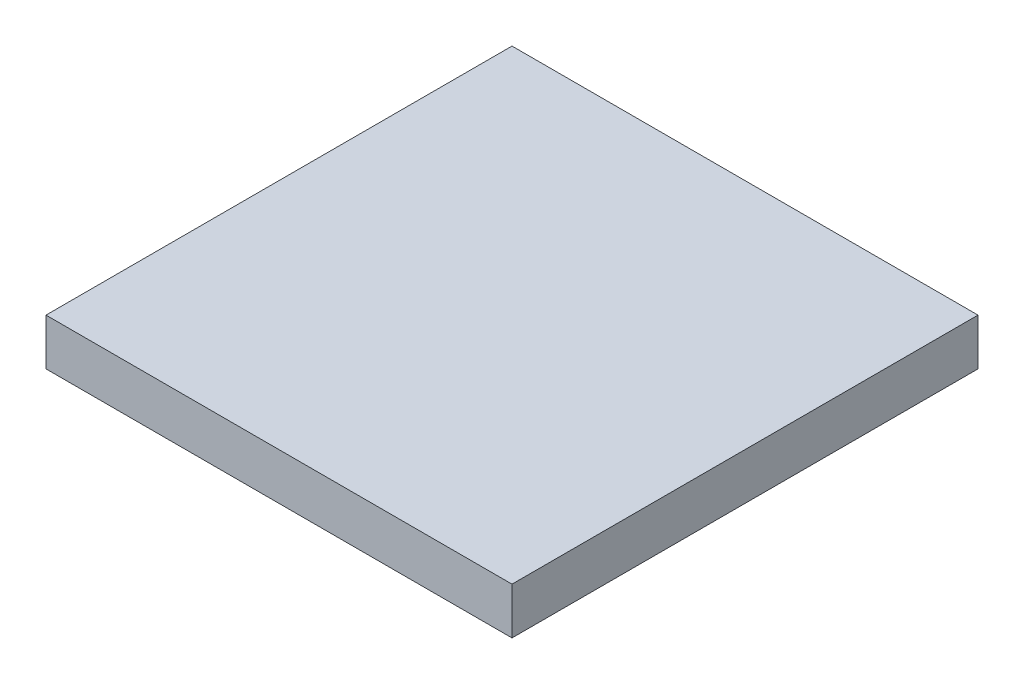
ISO-10303-21;
HEADER;
FILE_DESCRIPTION(('STEP AP214'),'2;1');
FILE_NAME('part.step','',(''),(''),'','','');
FILE_SCHEMA(('AUTOMOTIVE_DESIGN { 1 0 10303 214 1 1 1 1 }'));
ENDSEC;
DATA;
#1=APPLICATION_CONTEXT('core data for automotive mechanical design processes');
#2=APPLICATION_PROTOCOL_DEFINITION('international standard','automotive_design',2000,#1);
#3=PRODUCT_CONTEXT('',#1,'mechanical');
#4=PRODUCT('Part','Part','',(#3));
#5=PRODUCT_RELATED_PRODUCT_CATEGORY('part','',(#4));
#6=PRODUCT_DEFINITION_FORMATION('','',#4);
#7=PRODUCT_DEFINITION_CONTEXT('part definition',#1,'design');
#8=PRODUCT_DEFINITION('design','',#6,#7);
#9=PRODUCT_DEFINITION_SHAPE('','',#8);
#10=(LENGTH_UNIT() NAMED_UNIT(*) SI_UNIT(.MILLI.,.METRE.));
#11=(NAMED_UNIT(*) PLANE_ANGLE_UNIT() SI_UNIT($,.RADIAN.));
#12=(NAMED_UNIT(*) SI_UNIT($,.STERADIAN.) SOLID_ANGLE_UNIT());
#13=UNCERTAINTY_MEASURE_WITH_UNIT(LENGTH_MEASURE(1.E-05),#10,'distance_accuracy_value','');
#14=(GEOMETRIC_REPRESENTATION_CONTEXT(3) GLOBAL_UNCERTAINTY_ASSIGNED_CONTEXT((#13)) GLOBAL_UNIT_ASSIGNED_CONTEXT((#10,
#11,#12)) REPRESENTATION_CONTEXT('',''));
#15=CARTESIAN_POINT('',(0.,0.,0.));
#16=DIRECTION('',(0.,0.,1.));
#17=DIRECTION('',(1.,0.,0.));
#18=AXIS2_PLACEMENT_3D('',#15,#16,#17);
#19=CARTESIAN_POINT('',(5.00000000000013,-1.,-5.));
#20=DIRECTION('',(0.,1.,0.));
#21=DIRECTION('',(0.,0.,1.));
#22=AXIS2_PLACEMENT_3D('',#19,#20,#21);
#23=CYLINDRICAL_SURFACE('',#22,1.5);
#24=CARTESIAN_POINT('',(5.00000000000013,-1.,-5.));
#25=DIRECTION('',(0.,1.,0.));
#26=DIRECTION('',(0.,0.,1.));
#27=AXIS2_PLACEMENT_3D('',#24,#25,#26);
#28=CIRCLE('',#27,1.5);
#29=CARTESIAN_POINT('',(5.00000000000013,-1.,-3.5));
#30=VERTEX_POINT('',#29);
#31=EDGE_CURVE('E379',#30,#30,#28,.T.);
#32=ORIENTED_EDGE('',*,*,#31,.F.);
#33=EDGE_LOOP('',(#32));
#34=FACE_BOUND('',#33,.T.);
#35=CARTESIAN_POINT('',(5.00000000000013,0.,-5.));
#36=DIRECTION('',(0.,1.,0.));
#37=DIRECTION('',(0.,0.,1.));
#38=AXIS2_PLACEMENT_3D('',#35,#36,#37);
#39=CIRCLE('',#38,1.5);
#40=CARTESIAN_POINT('',(5.00000000000013,0.,-3.5));
#41=VERTEX_POINT('',#40);
#42=EDGE_CURVE('E370',#41,#41,#39,.F.);
#43=ORIENTED_EDGE('',*,*,#42,.F.);
#44=EDGE_LOOP('',(#43));
#45=FACE_BOUND('',#44,.T.);
#46=ADVANCED_FACE('F170',(#34,#45),#23,.F.);
#47=CARTESIAN_POINT('',(5.00000000000013,-1.,-5.));
#48=DIRECTION('',(0.,1.,0.));
#49=DIRECTION('',(0.,0.,1.));
#50=AXIS2_PLACEMENT_3D('',#47,#48,#49);
#51=CYLINDRICAL_SURFACE('',#50,2.03553390593276);
#52=CARTESIAN_POINT('',(5.00000000000013,-1.,-5.));
#53=DIRECTION('',(0.,1.,0.));
#54=DIRECTION('',(0.,0.,1.));
#55=AXIS2_PLACEMENT_3D('',#52,#53,#54);
#56=CIRCLE('',#55,2.03553390593276);
#57=CARTESIAN_POINT('',(5.00000000000013,-1.,-2.96446609406724));
#58=VERTEX_POINT('',#57);
#59=EDGE_CURVE('E382',#58,#58,#56,.T.);
#60=ORIENTED_EDGE('',*,*,#59,.T.);
#61=EDGE_LOOP('',(#60));
#62=FACE_BOUND('',#61,.T.);
#63=CARTESIAN_POINT('',(5.00000000000013,0.,-5.));
#64=DIRECTION('',(0.,1.,0.));
#65=DIRECTION('',(0.,0.,1.));
#66=AXIS2_PLACEMENT_3D('',#63,#64,#65);
#67=CIRCLE('',#66,2.03553390593276);
#68=CARTESIAN_POINT('',(5.00000000000013,0.,-2.96446609406724));
#69=VERTEX_POINT('',#68);
#70=EDGE_CURVE('E378',#69,#69,#67,.T.);
#71=ORIENTED_EDGE('',*,*,#70,.F.);
#72=EDGE_LOOP('',(#71));
#73=FACE_BOUND('',#72,.T.);
#74=ADVANCED_FACE('F437',(#62,#73),#51,.T.);
#75=CARTESIAN_POINT('',(0.,-1.,0.));
#76=DIRECTION('',(0.,1.,0.));
#77=DIRECTION('',(0.,0.,1.));
#78=AXIS2_PLACEMENT_3D('',#75,#76,#77);
#79=PLANE('',#78);
#80=ORIENTED_EDGE('',*,*,#31,.T.);
#81=EDGE_LOOP('',(#80));
#82=FACE_BOUND('',#81,.T.);
#83=ORIENTED_EDGE('',*,*,#59,.F.);
#84=EDGE_LOOP('',(#83));
#85=FACE_BOUND('',#84,.T.);
#86=ADVANCED_FACE('F442',(#82,#85),#79,.F.);
#87=CARTESIAN_POINT('',(0.,0.,0.));
#88=DIRECTION('',(0.,1.,0.));
#89=DIRECTION('',(0.,0.,1.));
#90=AXIS2_PLACEMENT_3D('',#87,#88,#89);
#91=PLANE('',#90);
#92=DIRECTION('',(1.,0.,0.));
#93=VECTOR('',#92,1.);
#94=CARTESIAN_POINT('',(0.,0.,-1.));
#95=LINE('',#94,#93);
#96=CARTESIAN_POINT('',(1.,0.,-1.));
#97=VERTEX_POINT('',#96);
#98=CARTESIAN_POINT('',(19.,0.,-1.));
#99=VERTEX_POINT('',#98);
#100=EDGE_CURVE('E261',#97,#99,#95,.T.);
#101=ORIENTED_EDGE('',*,*,#100,.F.);
#102=DIRECTION('',(0.,0.,-1.));
#103=VECTOR('',#102,1.);
#104=CARTESIAN_POINT('',(1.,0.,0.));
#105=LINE('',#104,#103);
#106=CARTESIAN_POINT('',(1.,0.,-19.));
#107=VERTEX_POINT('',#106);
#108=EDGE_CURVE('E279',#97,#107,#105,.T.);
#109=ORIENTED_EDGE('',*,*,#108,.T.);
#110=DIRECTION('',(1.,0.,0.));
#111=VECTOR('',#110,1.);
#112=CARTESIAN_POINT('',(0.,0.,-19.));
#113=LINE('',#112,#111);
#114=CARTESIAN_POINT('',(19.,0.,-19.));
#115=VERTEX_POINT('',#114);
#116=EDGE_CURVE('E242',#107,#115,#113,.T.);
#117=ORIENTED_EDGE('',*,*,#116,.T.);
#118=DIRECTION('',(0.,0.,-1.));
#119=VECTOR('',#118,1.);
#120=CARTESIAN_POINT('',(19.,0.,0.));
#121=LINE('',#120,#119);
#122=EDGE_CURVE('E184',#99,#115,#121,.T.);
#123=ORIENTED_EDGE('',*,*,#122,.F.);
#124=EDGE_LOOP('',(#101,#109,#117,#123));
#125=FACE_BOUND('',#124,.T.);
#126=CARTESIAN_POINT('',(10.,0.,-15.));
#127=DIRECTION('',(0.,1.,0.));
#128=DIRECTION('',(0.,0.,1.));
#129=AXIS2_PLACEMENT_3D('',#126,#127,#128);
#130=CIRCLE('',#129,2.03553390593276);
#131=CARTESIAN_POINT('',(10.,0.,-12.9644660940672));
#132=VERTEX_POINT('',#131);
#133=EDGE_CURVE('E284',#132,#132,#130,.T.);
#134=ORIENTED_EDGE('',*,*,#133,.T.);
#135=EDGE_LOOP('',(#134));
#136=FACE_BOUND('',#135,.T.);
#137=CARTESIAN_POINT('',(10.0000000000001,0.,-10.));
#138=DIRECTION('',(0.,1.,0.));
#139=DIRECTION('',(0.,0.,1.));
#140=AXIS2_PLACEMENT_3D('',#137,#138,#139);
#141=CIRCLE('',#140,2.03553390593276);
#142=CARTESIAN_POINT('',(10.0000000000001,0.,-7.96446609406724));
#143=VERTEX_POINT('',#142);
#144=EDGE_CURVE('E294',#143,#143,#141,.T.);
#145=ORIENTED_EDGE('',*,*,#144,.T.);
#146=EDGE_LOOP('',(#145));
#147=FACE_BOUND('',#146,.T.);
#148=CARTESIAN_POINT('',(15.0000000000001,0.,-10.));
#149=DIRECTION('',(0.,1.,0.));
#150=DIRECTION('',(0.,0.,1.));
#151=AXIS2_PLACEMENT_3D('',#148,#149,#150);
#152=CIRCLE('',#151,2.03553390593276);
#153=CARTESIAN_POINT('',(15.0000000000001,0.,-7.96446609406724));
#154=VERTEX_POINT('',#153);
#155=EDGE_CURVE('E303',#154,#154,#152,.T.);
#156=ORIENTED_EDGE('',*,*,#155,.T.);
#157=EDGE_LOOP('',(#156));
#158=FACE_BOUND('',#157,.T.);
#159=CARTESIAN_POINT('',(15.,0.,-15.));
#160=DIRECTION('',(0.,1.,0.));
#161=DIRECTION('',(0.,0.,1.));
#162=AXIS2_PLACEMENT_3D('',#159,#160,#161);
#163=CIRCLE('',#162,2.03553390593276);
#164=CARTESIAN_POINT('',(15.,0.,-12.9644660940672));
#165=VERTEX_POINT('',#164);
#166=EDGE_CURVE('E312',#165,#165,#163,.T.);
#167=ORIENTED_EDGE('',*,*,#166,.T.);
#168=EDGE_LOOP('',(#167));
#169=FACE_BOUND('',#168,.T.);
#170=CARTESIAN_POINT('',(15.0000000000001,0.,-5.));
#171=DIRECTION('',(0.,1.,0.));
#172=DIRECTION('',(0.,0.,1.));
#173=AXIS2_PLACEMENT_3D('',#170,#171,#172);
#174=CIRCLE('',#173,2.03553390593276);
#175=CARTESIAN_POINT('',(15.0000000000001,0.,-2.96446609406724));
#176=VERTEX_POINT('',#175);
#177=EDGE_CURVE('E321',#176,#176,#174,.T.);
#178=ORIENTED_EDGE('',*,*,#177,.T.);
#179=EDGE_LOOP('',(#178));
#180=FACE_BOUND('',#179,.T.);
#181=CARTESIAN_POINT('',(10.0000000000001,0.,-5.));
#182=DIRECTION('',(0.,1.,0.));
#183=DIRECTION('',(0.,0.,1.));
#184=AXIS2_PLACEMENT_3D('',#181,#182,#183);
#185=CIRCLE('',#184,2.03553390593276);
#186=CARTESIAN_POINT('',(10.0000000000001,0.,-2.96446609406724));
#187=VERTEX_POINT('',#186);
#188=EDGE_CURVE('E330',#187,#187,#185,.T.);
#189=ORIENTED_EDGE('',*,*,#188,.T.);
#190=EDGE_LOOP('',(#189));
#191=FACE_BOUND('',#190,.T.);
#192=CARTESIAN_POINT('',(5.00000000000002,0.,-15.));
#193=DIRECTION('',(0.,1.,0.));
#194=DIRECTION('',(0.,0.,1.));
#195=AXIS2_PLACEMENT_3D('',#192,#193,#194);
#196=CIRCLE('',#195,2.03553390593276);
#197=CARTESIAN_POINT('',(5.00000000000002,0.,-12.9644660940672));
#198=VERTEX_POINT('',#197);
#199=EDGE_CURVE('E339',#198,#198,#196,.T.);
#200=ORIENTED_EDGE('',*,*,#199,.T.);
#201=EDGE_LOOP('',(#200));
#202=FACE_BOUND('',#201,.T.);
#203=CARTESIAN_POINT('',(5.00000000000008,0.,-10.));
#204=DIRECTION('',(0.,1.,0.));
#205=DIRECTION('',(0.,0.,1.));
#206=AXIS2_PLACEMENT_3D('',#203,#204,#205);
#207=CIRCLE('',#206,2.03553390593276);
#208=CARTESIAN_POINT('',(5.00000000000008,0.,-7.96446609406724));
#209=VERTEX_POINT('',#208);
#210=EDGE_CURVE('E348',#209,#209,#207,.T.);
#211=ORIENTED_EDGE('',*,*,#210,.T.);
#212=EDGE_LOOP('',(#211));
#213=FACE_BOUND('',#212,.T.);
#214=ORIENTED_EDGE('',*,*,#70,.T.);
#215=EDGE_LOOP('',(#214));
#216=FACE_BOUND('',#215,.T.);
#217=ADVANCED_FACE('F428',(#125,#136,#147,#158,#169,#180,#191,#202,#213,#216),#91,.F.);
#218=ORIENTED_EDGE('',*,*,#42,.T.);
#219=EDGE_LOOP('',(#218));
#220=FACE_BOUND('',#219,.T.);
#221=ADVANCED_FACE('F448',(#220),#91,.F.);
#222=CARTESIAN_POINT('',(5.00000000000008,-1.,-10.));
#223=DIRECTION('',(0.,1.,0.));
#224=DIRECTION('',(0.,0.,1.));
#225=AXIS2_PLACEMENT_3D('',#222,#223,#224);
#226=CYLINDRICAL_SURFACE('',#225,1.5);
#227=CARTESIAN_POINT('',(5.00000000000008,-1.,-10.));
#228=DIRECTION('',(0.,1.,0.));
#229=DIRECTION('',(0.,0.,1.));
#230=AXIS2_PLACEMENT_3D('',#227,#228,#229);
#231=CIRCLE('',#230,1.5);
#232=CARTESIAN_POINT('',(5.00000000000008,-1.,-8.5));
#233=VERTEX_POINT('',#232);
#234=EDGE_CURVE('E351',#233,#233,#231,.T.);
#235=ORIENTED_EDGE('',*,*,#234,.F.);
#236=EDGE_LOOP('',(#235));
#237=FACE_BOUND('',#236,.T.);
#238=CARTESIAN_POINT('',(5.00000000000008,0.,-10.));
#239=DIRECTION('',(0.,1.,0.));
#240=DIRECTION('',(0.,0.,1.));
#241=AXIS2_PLACEMENT_3D('',#238,#239,#240);
#242=CIRCLE('',#241,1.5);
#243=CARTESIAN_POINT('',(5.00000000000008,0.,-8.5));
#244=VERTEX_POINT('',#243);
#245=EDGE_CURVE('E385',#244,#244,#242,.T.);
#246=ORIENTED_EDGE('',*,*,#245,.T.);
#247=EDGE_LOOP('',(#246));
#248=FACE_BOUND('',#247,.T.);
#249=ADVANCED_FACE('F450',(#237,#248),#226,.F.);
#250=CARTESIAN_POINT('',(5.00000000000008,-1.,-10.));
#251=DIRECTION('',(0.,1.,0.));
#252=DIRECTION('',(0.,0.,1.));
#253=AXIS2_PLACEMENT_3D('',#250,#251,#252);
#254=CYLINDRICAL_SURFACE('',#253,2.03553390593276);
#255=CARTESIAN_POINT('',(5.00000000000008,-1.,-10.));
#256=DIRECTION('',(0.,1.,0.));
#257=DIRECTION('',(0.,0.,1.));
#258=AXIS2_PLACEMENT_3D('',#255,#256,#257);
#259=CIRCLE('',#258,2.03553390593276);
#260=CARTESIAN_POINT('',(5.00000000000008,-1.,-7.96446609406724));
#261=VERTEX_POINT('',#260);
#262=EDGE_CURVE('E354',#261,#261,#259,.T.);
#263=ORIENTED_EDGE('',*,*,#262,.T.);
#264=EDGE_LOOP('',(#263));
#265=FACE_BOUND('',#264,.T.);
#266=ORIENTED_EDGE('',*,*,#210,.F.);
#267=EDGE_LOOP('',(#266));
#268=FACE_BOUND('',#267,.T.);
#269=ADVANCED_FACE('F457',(#265,#268),#254,.T.);
#270=CARTESIAN_POINT('',(0.,-1.,0.));
#271=DIRECTION('',(0.,1.,0.));
#272=DIRECTION('',(0.,0.,1.));
#273=AXIS2_PLACEMENT_3D('',#270,#271,#272);
#274=PLANE('',#273);
#275=ORIENTED_EDGE('',*,*,#234,.T.);
#276=EDGE_LOOP('',(#275));
#277=FACE_BOUND('',#276,.T.);
#278=ORIENTED_EDGE('',*,*,#262,.F.);
#279=EDGE_LOOP('',(#278));
#280=FACE_BOUND('',#279,.T.);
#281=ADVANCED_FACE('F462',(#277,#280),#274,.F.);
#282=ORIENTED_EDGE('',*,*,#245,.F.);
#283=EDGE_LOOP('',(#282));
#284=FACE_BOUND('',#283,.T.);
#285=ADVANCED_FACE('F451',(#284),#91,.F.);
#286=CARTESIAN_POINT('',(5.00000000000002,-1.,-15.));
#287=DIRECTION('',(0.,1.,0.));
#288=DIRECTION('',(0.,0.,1.));
#289=AXIS2_PLACEMENT_3D('',#286,#287,#288);
#290=CYLINDRICAL_SURFACE('',#289,1.5);
#291=CARTESIAN_POINT('',(5.00000000000002,-1.,-15.));
#292=DIRECTION('',(0.,1.,0.));
#293=DIRECTION('',(0.,0.,1.));
#294=AXIS2_PLACEMENT_3D('',#291,#292,#293);
#295=CIRCLE('',#294,1.5);
#296=CARTESIAN_POINT('',(5.00000000000002,-1.,-13.5));
#297=VERTEX_POINT('',#296);
#298=EDGE_CURVE('E342',#297,#297,#295,.T.);
#299=ORIENTED_EDGE('',*,*,#298,.F.);
#300=EDGE_LOOP('',(#299));
#301=FACE_BOUND('',#300,.T.);
#302=CARTESIAN_POINT('',(5.00000000000002,0.,-15.));
#303=DIRECTION('',(0.,1.,0.));
#304=DIRECTION('',(0.,0.,1.));
#305=AXIS2_PLACEMENT_3D('',#302,#303,#304);
#306=CIRCLE('',#305,1.5);
#307=CARTESIAN_POINT('',(5.00000000000002,0.,-13.5));
#308=VERTEX_POINT('',#307);
#309=EDGE_CURVE('E390',#308,#308,#306,.T.);
#310=ORIENTED_EDGE('',*,*,#309,.T.);
#311=EDGE_LOOP('',(#310));
#312=FACE_BOUND('',#311,.T.);
#313=ADVANCED_FACE('F461',(#301,#312),#290,.F.);
#314=CARTESIAN_POINT('',(5.00000000000002,-1.,-15.));
#315=DIRECTION('',(0.,1.,0.));
#316=DIRECTION('',(0.,0.,1.));
#317=AXIS2_PLACEMENT_3D('',#314,#315,#316);
#318=CYLINDRICAL_SURFACE('',#317,2.03553390593276);
#319=CARTESIAN_POINT('',(5.00000000000002,-1.,-15.));
#320=DIRECTION('',(0.,1.,0.));
#321=DIRECTION('',(0.,0.,1.));
#322=AXIS2_PLACEMENT_3D('',#319,#320,#321);
#323=CIRCLE('',#322,2.03553390593276);
#324=CARTESIAN_POINT('',(5.00000000000002,-1.,-12.9644660940672));
#325=VERTEX_POINT('',#324);
#326=EDGE_CURVE('E345',#325,#325,#323,.T.);
#327=ORIENTED_EDGE('',*,*,#326,.T.);
#328=EDGE_LOOP('',(#327));
#329=FACE_BOUND('',#328,.T.);
#330=ORIENTED_EDGE('',*,*,#199,.F.);
#331=EDGE_LOOP('',(#330));
#332=FACE_BOUND('',#331,.T.);
#333=ADVANCED_FACE('F469',(#329,#332),#318,.T.);
#334=CARTESIAN_POINT('',(0.,-1.,0.));
#335=DIRECTION('',(0.,1.,0.));
#336=DIRECTION('',(0.,0.,1.));
#337=AXIS2_PLACEMENT_3D('',#334,#335,#336);
#338=PLANE('',#337);
#339=ORIENTED_EDGE('',*,*,#298,.T.);
#340=EDGE_LOOP('',(#339));
#341=FACE_BOUND('',#340,.T.);
#342=ORIENTED_EDGE('',*,*,#326,.F.);
#343=EDGE_LOOP('',(#342));
#344=FACE_BOUND('',#343,.T.);
#345=ADVANCED_FACE('F477',(#341,#344),#338,.F.);
#346=ORIENTED_EDGE('',*,*,#309,.F.);
#347=EDGE_LOOP('',(#346));
#348=FACE_BOUND('',#347,.T.);
#349=ADVANCED_FACE('F464',(#348),#91,.F.);
#350=CARTESIAN_POINT('',(10.0000000000001,-1.,-5.));
#351=DIRECTION('',(0.,1.,0.));
#352=DIRECTION('',(0.,0.,1.));
#353=AXIS2_PLACEMENT_3D('',#350,#351,#352);
#354=CYLINDRICAL_SURFACE('',#353,1.5);
#355=CARTESIAN_POINT('',(10.0000000000001,-1.,-5.));
#356=DIRECTION('',(0.,1.,0.));
#357=DIRECTION('',(0.,0.,1.));
#358=AXIS2_PLACEMENT_3D('',#355,#356,#357);
#359=CIRCLE('',#358,1.5);
#360=CARTESIAN_POINT('',(10.0000000000001,-1.,-3.5));
#361=VERTEX_POINT('',#360);
#362=EDGE_CURVE('E333',#361,#361,#359,.T.);
#363=ORIENTED_EDGE('',*,*,#362,.F.);
#364=EDGE_LOOP('',(#363));
#365=FACE_BOUND('',#364,.T.);
#366=CARTESIAN_POINT('',(10.0000000000001,0.,-5.));
#367=DIRECTION('',(0.,1.,0.));
#368=DIRECTION('',(0.,0.,1.));
#369=AXIS2_PLACEMENT_3D('',#366,#367,#368);
#370=CIRCLE('',#369,1.5);
#371=CARTESIAN_POINT('',(10.0000000000001,0.,-3.5));
#372=VERTEX_POINT('',#371);
#373=EDGE_CURVE('E393',#372,#372,#370,.T.);
#374=ORIENTED_EDGE('',*,*,#373,.T.);
#375=EDGE_LOOP('',(#374));
#376=FACE_BOUND('',#375,.T.);
#377=ADVANCED_FACE('F476',(#365,#376),#354,.F.);
#378=CARTESIAN_POINT('',(10.0000000000001,-1.,-5.));
#379=DIRECTION('',(0.,1.,0.));
#380=DIRECTION('',(0.,0.,1.));
#381=AXIS2_PLACEMENT_3D('',#378,#379,#380);
#382=CYLINDRICAL_SURFACE('',#381,2.03553390593276);
#383=CARTESIAN_POINT('',(10.0000000000001,-1.,-5.));
#384=DIRECTION('',(0.,1.,0.));
#385=DIRECTION('',(0.,0.,1.));
#386=AXIS2_PLACEMENT_3D('',#383,#384,#385);
#387=CIRCLE('',#386,2.03553390593276);
#388=CARTESIAN_POINT('',(10.0000000000001,-1.,-2.96446609406724));
#389=VERTEX_POINT('',#388);
#390=EDGE_CURVE('E336',#389,#389,#387,.T.);
#391=ORIENTED_EDGE('',*,*,#390,.T.);
#392=EDGE_LOOP('',(#391));
#393=FACE_BOUND('',#392,.T.);
#394=ORIENTED_EDGE('',*,*,#188,.F.);
#395=EDGE_LOOP('',(#394));
#396=FACE_BOUND('',#395,.T.);
#397=ADVANCED_FACE('F484',(#393,#396),#382,.T.);
#398=CARTESIAN_POINT('',(0.,-1.,0.));
#399=DIRECTION('',(0.,1.,0.));
#400=DIRECTION('',(0.,0.,1.));
#401=AXIS2_PLACEMENT_3D('',#398,#399,#400);
#402=PLANE('',#401);
#403=ORIENTED_EDGE('',*,*,#362,.T.);
#404=EDGE_LOOP('',(#403));
#405=FACE_BOUND('',#404,.T.);
#406=ORIENTED_EDGE('',*,*,#390,.F.);
#407=EDGE_LOOP('',(#406));
#408=FACE_BOUND('',#407,.T.);
#409=ADVANCED_FACE('F492',(#405,#408),#402,.F.);
#410=ORIENTED_EDGE('',*,*,#373,.F.);
#411=EDGE_LOOP('',(#410));
#412=FACE_BOUND('',#411,.T.);
#413=ADVANCED_FACE('F479',(#412),#91,.F.);
#414=CARTESIAN_POINT('',(15.0000000000001,-1.,-5.));
#415=DIRECTION('',(0.,1.,0.));
#416=DIRECTION('',(0.,0.,1.));
#417=AXIS2_PLACEMENT_3D('',#414,#415,#416);
#418=CYLINDRICAL_SURFACE('',#417,1.5);
#419=CARTESIAN_POINT('',(15.0000000000001,-1.,-5.));
#420=DIRECTION('',(0.,1.,0.));
#421=DIRECTION('',(0.,0.,1.));
#422=AXIS2_PLACEMENT_3D('',#419,#420,#421);
#423=CIRCLE('',#422,1.5);
#424=CARTESIAN_POINT('',(15.0000000000001,-1.,-3.5));
#425=VERTEX_POINT('',#424);
#426=EDGE_CURVE('E324',#425,#425,#423,.T.);
#427=ORIENTED_EDGE('',*,*,#426,.F.);
#428=EDGE_LOOP('',(#427));
#429=FACE_BOUND('',#428,.T.);
#430=CARTESIAN_POINT('',(15.0000000000001,0.,-5.));
#431=DIRECTION('',(0.,1.,0.));
#432=DIRECTION('',(0.,0.,1.));
#433=AXIS2_PLACEMENT_3D('',#430,#431,#432);
#434=CIRCLE('',#433,1.5);
#435=CARTESIAN_POINT('',(15.0000000000001,0.,-3.5));
#436=VERTEX_POINT('',#435);
#437=EDGE_CURVE('E396',#436,#436,#434,.T.);
#438=ORIENTED_EDGE('',*,*,#437,.T.);
#439=EDGE_LOOP('',(#438));
#440=FACE_BOUND('',#439,.T.);
#441=ADVANCED_FACE('F491',(#429,#440),#418,.F.);
#442=CARTESIAN_POINT('',(15.0000000000001,-1.,-5.));
#443=DIRECTION('',(0.,1.,0.));
#444=DIRECTION('',(0.,0.,1.));
#445=AXIS2_PLACEMENT_3D('',#442,#443,#444);
#446=CYLINDRICAL_SURFACE('',#445,2.03553390593276);
#447=CARTESIAN_POINT('',(15.0000000000001,-1.,-5.));
#448=DIRECTION('',(0.,1.,0.));
#449=DIRECTION('',(0.,0.,1.));
#450=AXIS2_PLACEMENT_3D('',#447,#448,#449);
#451=CIRCLE('',#450,2.03553390593276);
#452=CARTESIAN_POINT('',(15.0000000000001,-1.,-2.96446609406724));
#453=VERTEX_POINT('',#452);
#454=EDGE_CURVE('E327',#453,#453,#451,.T.);
#455=ORIENTED_EDGE('',*,*,#454,.T.);
#456=EDGE_LOOP('',(#455));
#457=FACE_BOUND('',#456,.T.);
#458=ORIENTED_EDGE('',*,*,#177,.F.);
#459=EDGE_LOOP('',(#458));
#460=FACE_BOUND('',#459,.T.);
#461=ADVANCED_FACE('F499',(#457,#460),#446,.T.);
#462=CARTESIAN_POINT('',(0.,-1.,0.));
#463=DIRECTION('',(0.,1.,0.));
#464=DIRECTION('',(0.,0.,1.));
#465=AXIS2_PLACEMENT_3D('',#462,#463,#464);
#466=PLANE('',#465);
#467=ORIENTED_EDGE('',*,*,#426,.T.);
#468=EDGE_LOOP('',(#467));
#469=FACE_BOUND('',#468,.T.);
#470=ORIENTED_EDGE('',*,*,#454,.F.);
#471=EDGE_LOOP('',(#470));
#472=FACE_BOUND('',#471,.T.);
#473=ADVANCED_FACE('F507',(#469,#472),#466,.F.);
#474=ORIENTED_EDGE('',*,*,#437,.F.);
#475=EDGE_LOOP('',(#474));
#476=FACE_BOUND('',#475,.T.);
#477=ADVANCED_FACE('F494',(#476),#91,.F.);
#478=CARTESIAN_POINT('',(15.,-1.,-15.));
#479=DIRECTION('',(0.,1.,0.));
#480=DIRECTION('',(0.,0.,1.));
#481=AXIS2_PLACEMENT_3D('',#478,#479,#480);
#482=CYLINDRICAL_SURFACE('',#481,1.5);
#483=CARTESIAN_POINT('',(15.,-1.,-15.));
#484=DIRECTION('',(0.,1.,0.));
#485=DIRECTION('',(0.,0.,1.));
#486=AXIS2_PLACEMENT_3D('',#483,#484,#485);
#487=CIRCLE('',#486,1.5);
#488=CARTESIAN_POINT('',(15.,-1.,-13.5));
#489=VERTEX_POINT('',#488);
#490=EDGE_CURVE('E315',#489,#489,#487,.T.);
#491=ORIENTED_EDGE('',*,*,#490,.F.);
#492=EDGE_LOOP('',(#491));
#493=FACE_BOUND('',#492,.T.);
#494=CARTESIAN_POINT('',(15.,0.,-15.));
#495=DIRECTION('',(0.,1.,0.));
#496=DIRECTION('',(0.,0.,1.));
#497=AXIS2_PLACEMENT_3D('',#494,#495,#496);
#498=CIRCLE('',#497,1.5);
#499=CARTESIAN_POINT('',(15.,0.,-13.5));
#500=VERTEX_POINT('',#499);
#501=EDGE_CURVE('E399',#500,#500,#498,.T.);
#502=ORIENTED_EDGE('',*,*,#501,.T.);
#503=EDGE_LOOP('',(#502));
#504=FACE_BOUND('',#503,.T.);
#505=ADVANCED_FACE('F506',(#493,#504),#482,.F.);
#506=CARTESIAN_POINT('',(15.,-1.,-15.));
#507=DIRECTION('',(0.,1.,0.));
#508=DIRECTION('',(0.,0.,1.));
#509=AXIS2_PLACEMENT_3D('',#506,#507,#508);
#510=CYLINDRICAL_SURFACE('',#509,2.03553390593276);
#511=CARTESIAN_POINT('',(15.,-1.,-15.));
#512=DIRECTION('',(0.,1.,0.));
#513=DIRECTION('',(0.,0.,1.));
#514=AXIS2_PLACEMENT_3D('',#511,#512,#513);
#515=CIRCLE('',#514,2.03553390593276);
#516=CARTESIAN_POINT('',(15.,-1.,-12.9644660940672));
#517=VERTEX_POINT('',#516);
#518=EDGE_CURVE('E318',#517,#517,#515,.T.);
#519=ORIENTED_EDGE('',*,*,#518,.T.);
#520=EDGE_LOOP('',(#519));
#521=FACE_BOUND('',#520,.T.);
#522=ORIENTED_EDGE('',*,*,#166,.F.);
#523=EDGE_LOOP('',(#522));
#524=FACE_BOUND('',#523,.T.);
#525=ADVANCED_FACE('F513',(#521,#524),#510,.T.);
#526=CARTESIAN_POINT('',(0.,-1.,0.));
#527=DIRECTION('',(0.,1.,0.));
#528=DIRECTION('',(0.,0.,1.));
#529=AXIS2_PLACEMENT_3D('',#526,#527,#528);
#530=PLANE('',#529);
#531=ORIENTED_EDGE('',*,*,#490,.T.);
#532=EDGE_LOOP('',(#531));
#533=FACE_BOUND('',#532,.T.);
#534=ORIENTED_EDGE('',*,*,#518,.F.);
#535=EDGE_LOOP('',(#534));
#536=FACE_BOUND('',#535,.T.);
#537=ADVANCED_FACE('F521',(#533,#536),#530,.F.);
#538=ORIENTED_EDGE('',*,*,#501,.F.);
#539=EDGE_LOOP('',(#538));
#540=FACE_BOUND('',#539,.T.);
#541=ADVANCED_FACE('F433',(#540),#91,.F.);
#542=CARTESIAN_POINT('',(15.0000000000001,-1.,-10.));
#543=DIRECTION('',(0.,1.,0.));
#544=DIRECTION('',(0.,0.,1.));
#545=AXIS2_PLACEMENT_3D('',#542,#543,#544);
#546=CYLINDRICAL_SURFACE('',#545,1.5);
#547=CARTESIAN_POINT('',(15.0000000000001,-1.,-10.));
#548=DIRECTION('',(0.,1.,0.));
#549=DIRECTION('',(0.,0.,1.));
#550=AXIS2_PLACEMENT_3D('',#547,#548,#549);
#551=CIRCLE('',#550,1.5);
#552=CARTESIAN_POINT('',(15.0000000000001,-1.,-8.5));
#553=VERTEX_POINT('',#552);
#554=EDGE_CURVE('E306',#553,#553,#551,.T.);
#555=ORIENTED_EDGE('',*,*,#554,.F.);
#556=EDGE_LOOP('',(#555));
#557=FACE_BOUND('',#556,.T.);
#558=CARTESIAN_POINT('',(15.0000000000001,0.,-10.));
#559=DIRECTION('',(0.,1.,0.));
#560=DIRECTION('',(0.,0.,1.));
#561=AXIS2_PLACEMENT_3D('',#558,#559,#560);
#562=CIRCLE('',#561,1.5);
#563=CARTESIAN_POINT('',(15.0000000000001,0.,-8.5));
#564=VERTEX_POINT('',#563);
#565=EDGE_CURVE('E402',#564,#564,#562,.T.);
#566=ORIENTED_EDGE('',*,*,#565,.T.);
#567=EDGE_LOOP('',(#566));
#568=FACE_BOUND('',#567,.T.);
#569=ADVANCED_FACE('F520',(#557,#568),#546,.F.);
#570=CARTESIAN_POINT('',(15.0000000000001,-1.,-10.));
#571=DIRECTION('',(0.,1.,0.));
#572=DIRECTION('',(0.,0.,1.));
#573=AXIS2_PLACEMENT_3D('',#570,#571,#572);
#574=CYLINDRICAL_SURFACE('',#573,2.03553390593276);
#575=CARTESIAN_POINT('',(15.0000000000001,-1.,-10.));
#576=DIRECTION('',(0.,1.,0.));
#577=DIRECTION('',(0.,0.,1.));
#578=AXIS2_PLACEMENT_3D('',#575,#576,#577);
#579=CIRCLE('',#578,2.03553390593276);
#580=CARTESIAN_POINT('',(15.0000000000001,-1.,-7.96446609406724));
#581=VERTEX_POINT('',#580);
#582=EDGE_CURVE('E309',#581,#581,#579,.T.);
#583=ORIENTED_EDGE('',*,*,#582,.T.);
#584=EDGE_LOOP('',(#583));
#585=FACE_BOUND('',#584,.T.);
#586=ORIENTED_EDGE('',*,*,#155,.F.);
#587=EDGE_LOOP('',(#586));
#588=FACE_BOUND('',#587,.T.);
#589=ADVANCED_FACE('F526',(#585,#588),#574,.T.);
#590=CARTESIAN_POINT('',(0.,-1.,0.));
#591=DIRECTION('',(0.,1.,0.));
#592=DIRECTION('',(0.,0.,1.));
#593=AXIS2_PLACEMENT_3D('',#590,#591,#592);
#594=PLANE('',#593);
#595=ORIENTED_EDGE('',*,*,#554,.T.);
#596=EDGE_LOOP('',(#595));
#597=FACE_BOUND('',#596,.T.);
#598=ORIENTED_EDGE('',*,*,#582,.F.);
#599=EDGE_LOOP('',(#598));
#600=FACE_BOUND('',#599,.T.);
#601=ADVANCED_FACE('F431',(#597,#600),#594,.F.);
#602=ORIENTED_EDGE('',*,*,#565,.F.);
#603=EDGE_LOOP('',(#602));
#604=FACE_BOUND('',#603,.T.);
#605=ADVANCED_FACE('F414',(#604),#91,.F.);
#606=CARTESIAN_POINT('',(10.0000000000001,-1.,-10.));
#607=DIRECTION('',(0.,1.,0.));
#608=DIRECTION('',(0.,0.,1.));
#609=AXIS2_PLACEMENT_3D('',#606,#607,#608);
#610=CYLINDRICAL_SURFACE('',#609,1.5);
#611=CARTESIAN_POINT('',(10.0000000000001,-1.,-10.));
#612=DIRECTION('',(0.,1.,0.));
#613=DIRECTION('',(0.,0.,1.));
#614=AXIS2_PLACEMENT_3D('',#611,#612,#613);
#615=CIRCLE('',#614,1.5);
#616=CARTESIAN_POINT('',(10.0000000000001,-1.,-8.5));
#617=VERTEX_POINT('',#616);
#618=EDGE_CURVE('E297',#617,#617,#615,.T.);
#619=ORIENTED_EDGE('',*,*,#618,.F.);
#620=EDGE_LOOP('',(#619));
#621=FACE_BOUND('',#620,.T.);
#622=CARTESIAN_POINT('',(10.0000000000001,0.,-10.));
#623=DIRECTION('',(0.,1.,0.));
#624=DIRECTION('',(0.,0.,1.));
#625=AXIS2_PLACEMENT_3D('',#622,#623,#624);
#626=CIRCLE('',#625,1.5);
#627=CARTESIAN_POINT('',(10.0000000000001,0.,-8.5));
#628=VERTEX_POINT('',#627);
#629=EDGE_CURVE('E177',#628,#628,#626,.T.);
#630=ORIENTED_EDGE('',*,*,#629,.T.);
#631=EDGE_LOOP('',(#630));
#632=FACE_BOUND('',#631,.T.);
#633=ADVANCED_FACE('F407',(#621,#632),#610,.F.);
#634=CARTESIAN_POINT('',(10.0000000000001,-1.,-10.));
#635=DIRECTION('',(0.,1.,0.));
#636=DIRECTION('',(0.,0.,1.));
#637=AXIS2_PLACEMENT_3D('',#634,#635,#636);
#638=CYLINDRICAL_SURFACE('',#637,2.03553390593276);
#639=CARTESIAN_POINT('',(10.0000000000001,-1.,-10.));
#640=DIRECTION('',(0.,1.,0.));
#641=DIRECTION('',(0.,0.,1.));
#642=AXIS2_PLACEMENT_3D('',#639,#640,#641);
#643=CIRCLE('',#642,2.03553390593276);
#644=CARTESIAN_POINT('',(10.0000000000001,-1.,-7.96446609406724));
#645=VERTEX_POINT('',#644);
#646=EDGE_CURVE('E300',#645,#645,#643,.T.);
#647=ORIENTED_EDGE('',*,*,#646,.T.);
#648=EDGE_LOOP('',(#647));
#649=FACE_BOUND('',#648,.T.);
#650=ORIENTED_EDGE('',*,*,#144,.F.);
#651=EDGE_LOOP('',(#650));
#652=FACE_BOUND('',#651,.T.);
#653=ADVANCED_FACE('F425',(#649,#652),#638,.T.);
#654=CARTESIAN_POINT('',(0.,-1.,0.));
#655=DIRECTION('',(0.,1.,0.));
#656=DIRECTION('',(0.,0.,1.));
#657=AXIS2_PLACEMENT_3D('',#654,#655,#656);
#658=PLANE('',#657);
#659=ORIENTED_EDGE('',*,*,#618,.T.);
#660=EDGE_LOOP('',(#659));
#661=FACE_BOUND('',#660,.T.);
#662=ORIENTED_EDGE('',*,*,#646,.F.);
#663=EDGE_LOOP('',(#662));
#664=FACE_BOUND('',#663,.T.);
#665=ADVANCED_FACE('F412',(#661,#664),#658,.F.);
#666=ORIENTED_EDGE('',*,*,#629,.F.);
#667=EDGE_LOOP('',(#666));
#668=FACE_BOUND('',#667,.T.);
#669=ADVANCED_FACE('F409',(#668),#91,.F.);
#670=CARTESIAN_POINT('',(10.,-1.,-15.));
#671=DIRECTION('',(0.,1.,0.));
#672=DIRECTION('',(0.,0.,1.));
#673=AXIS2_PLACEMENT_3D('',#670,#671,#672);
#674=CYLINDRICAL_SURFACE('',#673,1.5);
#675=CARTESIAN_POINT('',(10.,-1.,-15.));
#676=DIRECTION('',(0.,1.,0.));
#677=DIRECTION('',(0.,0.,1.));
#678=AXIS2_PLACEMENT_3D('',#675,#676,#677);
#679=CIRCLE('',#678,1.5);
#680=CARTESIAN_POINT('',(10.,-1.,-13.5));
#681=VERTEX_POINT('',#680);
#682=EDGE_CURVE('E288',#681,#681,#679,.T.);
#683=ORIENTED_EDGE('',*,*,#682,.F.);
#684=EDGE_LOOP('',(#683));
#685=FACE_BOUND('',#684,.T.);
#686=CARTESIAN_POINT('',(10.,0.,-15.));
#687=DIRECTION('',(0.,1.,0.));
#688=DIRECTION('',(0.,0.,1.));
#689=AXIS2_PLACEMENT_3D('',#686,#687,#688);
#690=CIRCLE('',#689,1.5);
#691=CARTESIAN_POINT('',(10.,0.,-13.5));
#692=VERTEX_POINT('',#691);
#693=EDGE_CURVE('E12',#692,#692,#690,.T.);
#694=ORIENTED_EDGE('',*,*,#693,.T.);
#695=EDGE_LOOP('',(#694));
#696=FACE_BOUND('',#695,.T.);
#697=ADVANCED_FACE('F411',(#685,#696),#674,.F.);
#698=CARTESIAN_POINT('',(10.,-1.,-15.));
#699=DIRECTION('',(0.,1.,0.));
#700=DIRECTION('',(0.,0.,1.));
#701=AXIS2_PLACEMENT_3D('',#698,#699,#700);
#702=CYLINDRICAL_SURFACE('',#701,2.03553390593276);
#703=CARTESIAN_POINT('',(10.,-1.,-15.));
#704=DIRECTION('',(0.,1.,0.));
#705=DIRECTION('',(0.,0.,1.));
#706=AXIS2_PLACEMENT_3D('',#703,#704,#705);
#707=CIRCLE('',#706,2.03553390593276);
#708=CARTESIAN_POINT('',(10.,-1.,-12.9644660940672));
#709=VERTEX_POINT('',#708);
#710=EDGE_CURVE('E291',#709,#709,#707,.T.);
#711=ORIENTED_EDGE('',*,*,#710,.T.);
#712=EDGE_LOOP('',(#711));
#713=FACE_BOUND('',#712,.T.);
#714=ORIENTED_EDGE('',*,*,#133,.F.);
#715=EDGE_LOOP('',(#714));
#716=FACE_BOUND('',#715,.T.);
#717=ADVANCED_FACE('F421',(#713,#716),#702,.T.);
#718=CARTESIAN_POINT('',(0.,-1.,0.));
#719=DIRECTION('',(0.,1.,0.));
#720=DIRECTION('',(0.,0.,1.));
#721=AXIS2_PLACEMENT_3D('',#718,#719,#720);
#722=PLANE('',#721);
#723=ORIENTED_EDGE('',*,*,#682,.T.);
#724=EDGE_LOOP('',(#723));
#725=FACE_BOUND('',#724,.T.);
#726=ORIENTED_EDGE('',*,*,#710,.F.);
#727=EDGE_LOOP('',(#726));
#728=FACE_BOUND('',#727,.T.);
#729=ADVANCED_FACE('F434',(#725,#728),#722,.F.);
#730=ORIENTED_EDGE('',*,*,#693,.F.);
#731=EDGE_LOOP('',(#730));
#732=FACE_BOUND('',#731,.T.);
#733=ADVANCED_FACE('F415',(#732),#91,.F.);
#734=CARTESIAN_POINT('',(1.,-1.,0.));
#735=DIRECTION('',(1.,0.,0.));
#736=DIRECTION('',(0.,0.,-1.));
#737=AXIS2_PLACEMENT_3D('',#734,#735,#736);
#738=PLANE('',#737);
#739=ORIENTED_EDGE('',*,*,#108,.F.);
#740=DIRECTION('',(0.,1.,0.));
#741=VECTOR('',#740,1.);
#742=CARTESIAN_POINT('',(1.,-1.,-1.));
#743=LINE('',#742,#741);
#744=CARTESIAN_POINT('',(1.,-1.,-1.));
#745=VERTEX_POINT('',#744);
#746=EDGE_CURVE('E259',#745,#97,#743,.T.);
#747=ORIENTED_EDGE('',*,*,#746,.F.);
#748=DIRECTION('',(0.,0.,-1.));
#749=VECTOR('',#748,1.);
#750=CARTESIAN_POINT('',(1.,-1.,0.));
#751=LINE('',#750,#749);
#752=CARTESIAN_POINT('',(1.,-1.,-19.));
#753=VERTEX_POINT('',#752);
#754=EDGE_CURVE('E254',#745,#753,#751,.T.);
#755=ORIENTED_EDGE('',*,*,#754,.T.);
#756=DIRECTION('',(0.,1.,0.));
#757=VECTOR('',#756,1.);
#758=CARTESIAN_POINT('',(1.,-1.,-19.));
#759=LINE('',#758,#757);
#760=EDGE_CURVE('E237',#753,#107,#759,.T.);
#761=ORIENTED_EDGE('',*,*,#760,.T.);
#762=EDGE_LOOP('',(#739,#747,#755,#761));
#763=FACE_BOUND('',#762,.T.);
#764=ADVANCED_FACE('F258',(#763),#738,.T.);
#765=CARTESIAN_POINT('',(0.,-1.,-1.));
#766=DIRECTION('',(0.,0.,1.));
#767=DIRECTION('',(1.,0.,0.));
#768=AXIS2_PLACEMENT_3D('',#765,#766,#767);
#769=PLANE('',#768);
#770=ORIENTED_EDGE('',*,*,#100,.T.);
#771=DIRECTION('',(0.,1.,0.));
#772=VECTOR('',#771,1.);
#773=CARTESIAN_POINT('',(19.,-1.,-1.));
#774=LINE('',#773,#772);
#775=CARTESIAN_POINT('',(19.,-1.,-1.));
#776=VERTEX_POINT('',#775);
#777=EDGE_CURVE('E285',#776,#99,#774,.T.);
#778=ORIENTED_EDGE('',*,*,#777,.F.);
#779=DIRECTION('',(1.,0.,0.));
#780=VECTOR('',#779,1.);
#781=CARTESIAN_POINT('',(0.,-1.,-1.));
#782=LINE('',#781,#780);
#783=EDGE_CURVE('E266',#745,#776,#782,.T.);
#784=ORIENTED_EDGE('',*,*,#783,.F.);
#785=ORIENTED_EDGE('',*,*,#746,.T.);
#786=EDGE_LOOP('',(#770,#778,#784,#785));
#787=FACE_BOUND('',#786,.T.);
#788=ADVANCED_FACE('F740',(#787),#769,.F.);
#789=CARTESIAN_POINT('',(19.,-1.,0.));
#790=DIRECTION('',(1.,0.,0.));
#791=DIRECTION('',(0.,0.,-1.));
#792=AXIS2_PLACEMENT_3D('',#789,#790,#791);
#793=PLANE('',#792);
#794=ORIENTED_EDGE('',*,*,#122,.T.);
#795=DIRECTION('',(0.,1.,0.));
#796=VECTOR('',#795,1.);
#797=CARTESIAN_POINT('',(19.,-1.,-19.));
#798=LINE('',#797,#796);
#799=CARTESIAN_POINT('',(19.,-1.,-19.));
#800=VERTEX_POINT('',#799);
#801=EDGE_CURVE('E247',#800,#115,#798,.T.);
#802=ORIENTED_EDGE('',*,*,#801,.F.);
#803=DIRECTION('',(0.,0.,-1.));
#804=VECTOR('',#803,1.);
#805=CARTESIAN_POINT('',(19.,-1.,0.));
#806=LINE('',#805,#804);
#807=EDGE_CURVE('E256',#776,#800,#806,.T.);
#808=ORIENTED_EDGE('',*,*,#807,.F.);
#809=ORIENTED_EDGE('',*,*,#777,.T.);
#810=EDGE_LOOP('',(#794,#802,#808,#809));
#811=FACE_BOUND('',#810,.T.);
#812=ADVANCED_FACE('F748',(#811),#793,.F.);
#813=CARTESIAN_POINT('',(0.,-1.,-19.));
#814=DIRECTION('',(0.,0.,1.));
#815=DIRECTION('',(1.,0.,0.));
#816=AXIS2_PLACEMENT_3D('',#813,#814,#815);
#817=PLANE('',#816);
#818=ORIENTED_EDGE('',*,*,#116,.F.);
#819=ORIENTED_EDGE('',*,*,#760,.F.);
#820=DIRECTION('',(1.,0.,0.));
#821=VECTOR('',#820,1.);
#822=CARTESIAN_POINT('',(0.,-1.,-19.));
#823=LINE('',#822,#821);
#824=EDGE_CURVE('E240',#753,#800,#823,.T.);
#825=ORIENTED_EDGE('',*,*,#824,.T.);
#826=ORIENTED_EDGE('',*,*,#801,.T.);
#827=EDGE_LOOP('',(#818,#819,#825,#826));
#828=FACE_BOUND('',#827,.T.);
#829=ADVANCED_FACE('F239',(#828),#817,.T.);
#830=CARTESIAN_POINT('',(0.,-1.,0.));
#831=DIRECTION('',(0.,1.,0.));
#832=DIRECTION('',(0.,0.,1.));
#833=AXIS2_PLACEMENT_3D('',#830,#831,#832);
#834=PLANE('',#833);
#835=ORIENTED_EDGE('',*,*,#754,.F.);
#836=ORIENTED_EDGE('',*,*,#783,.T.);
#837=ORIENTED_EDGE('',*,*,#807,.T.);
#838=ORIENTED_EDGE('',*,*,#824,.F.);
#839=EDGE_LOOP('',(#835,#836,#837,#838));
#840=FACE_BOUND('',#839,.T.);
#841=DIRECTION('',(1.,0.,0.));
#842=VECTOR('',#841,1.);
#843=CARTESIAN_POINT('',(0.,-1.,-20.));
#844=LINE('',#843,#842);
#845=CARTESIAN_POINT('',(0.,-1.,-20.));
#846=VERTEX_POINT('',#845);
#847=CARTESIAN_POINT('',(20.,-1.,-20.));
#848=VERTEX_POINT('',#847);
#849=EDGE_CURVE('E268',#846,#848,#844,.T.);
#850=ORIENTED_EDGE('',*,*,#849,.T.);
#851=DIRECTION('',(0.,0.,-1.));
#852=VECTOR('',#851,1.);
#853=CARTESIAN_POINT('',(20.,-1.,0.));
#854=LINE('',#853,#852);
#855=CARTESIAN_POINT('',(20.,-1.,0.));
#856=VERTEX_POINT('',#855);
#857=EDGE_CURVE('E248',#856,#848,#854,.T.);
#858=ORIENTED_EDGE('',*,*,#857,.F.);
#859=DIRECTION('',(1.,0.,0.));
#860=VECTOR('',#859,1.);
#861=CARTESIAN_POINT('',(0.,-1.,0.));
#862=LINE('',#861,#860);
#863=CARTESIAN_POINT('',(0.,-1.,0.));
#864=VERTEX_POINT('',#863);
#865=EDGE_CURVE('E274',#864,#856,#862,.T.);
#866=ORIENTED_EDGE('',*,*,#865,.F.);
#867=DIRECTION('',(0.,0.,-1.));
#868=VECTOR('',#867,1.);
#869=CARTESIAN_POINT('',(0.,-1.,0.));
#870=LINE('',#869,#868);
#871=EDGE_CURVE('E271',#864,#846,#870,.T.);
#872=ORIENTED_EDGE('',*,*,#871,.T.);
#873=EDGE_LOOP('',(#850,#858,#866,#872));
#874=FACE_BOUND('',#873,.T.);
#875=ADVANCED_FACE('F252',(#840,#874),#834,.F.);
#876=CARTESIAN_POINT('',(0.,1.,0.));
#877=DIRECTION('',(0.,1.,0.));
#878=DIRECTION('',(0.,0.,1.));
#879=AXIS2_PLACEMENT_3D('',#876,#877,#878);
#880=PLANE('',#879);
#881=DIRECTION('',(1.,0.,0.));
#882=VECTOR('',#881,1.);
#883=CARTESIAN_POINT('',(0.,1.,-20.));
#884=LINE('',#883,#882);
#885=CARTESIAN_POINT('',(0.,1.,-20.));
#886=VERTEX_POINT('',#885);
#887=CARTESIAN_POINT('',(20.,1.,-20.));
#888=VERTEX_POINT('',#887);
#889=EDGE_CURVE('E357',#886,#888,#884,.T.);
#890=ORIENTED_EDGE('',*,*,#889,.F.);
#891=DIRECTION('',(0.,0.,-1.));
#892=VECTOR('',#891,1.);
#893=CARTESIAN_POINT('',(0.,1.,0.));
#894=LINE('',#893,#892);
#895=CARTESIAN_POINT('',(0.,1.,0.));
#896=VERTEX_POINT('',#895);
#897=EDGE_CURVE('E365',#896,#886,#894,.T.);
#898=ORIENTED_EDGE('',*,*,#897,.F.);
#899=DIRECTION('',(1.,0.,0.));
#900=VECTOR('',#899,1.);
#901=CARTESIAN_POINT('',(0.,1.,0.));
#902=LINE('',#901,#900);
#903=CARTESIAN_POINT('',(20.,1.,0.));
#904=VERTEX_POINT('',#903);
#905=EDGE_CURVE('E363',#896,#904,#902,.T.);
#906=ORIENTED_EDGE('',*,*,#905,.T.);
#907=DIRECTION('',(0.,0.,-1.));
#908=VECTOR('',#907,1.);
#909=CARTESIAN_POINT('',(20.,1.,0.));
#910=LINE('',#909,#908);
#911=EDGE_CURVE('E361',#904,#888,#910,.T.);
#912=ORIENTED_EDGE('',*,*,#911,.T.);
#913=EDGE_LOOP('',(#890,#898,#906,#912));
#914=FACE_BOUND('',#913,.T.);
#915=ADVANCED_FACE('F553',(#914),#880,.T.);
#916=CARTESIAN_POINT('',(0.,1.,-20.));
#917=DIRECTION('',(0.,0.,-1.));
#918=DIRECTION('',(-1.,0.,0.));
#919=AXIS2_PLACEMENT_3D('',#916,#917,#918);
#920=PLANE('',#919);
#921=DIRECTION('',(0.,-1.,0.));
#922=VECTOR('',#921,1.);
#923=CARTESIAN_POINT('',(20.,1.,-20.));
#924=LINE('',#923,#922);
#925=EDGE_CURVE('E368',#888,#848,#924,.T.);
#926=ORIENTED_EDGE('',*,*,#925,.T.);
#927=ORIENTED_EDGE('',*,*,#849,.F.);
#928=DIRECTION('',(0.,-1.,0.));
#929=VECTOR('',#928,1.);
#930=CARTESIAN_POINT('',(0.,1.,-20.));
#931=LINE('',#930,#929);
#932=EDGE_CURVE('E192',#886,#846,#931,.T.);
#933=ORIENTED_EDGE('',*,*,#932,.F.);
#934=ORIENTED_EDGE('',*,*,#889,.T.);
#935=EDGE_LOOP('',(#926,#927,#933,#934));
#936=FACE_BOUND('',#935,.T.);
#937=ADVANCED_FACE('F555',(#936),#920,.T.);
#938=CARTESIAN_POINT('',(0.,1.,0.));
#939=DIRECTION('',(-1.,0.,0.));
#940=DIRECTION('',(0.,0.,1.));
#941=AXIS2_PLACEMENT_3D('',#938,#939,#940);
#942=PLANE('',#941);
#943=ORIENTED_EDGE('',*,*,#932,.T.);
#944=ORIENTED_EDGE('',*,*,#871,.F.);
#945=DIRECTION('',(0.,-1.,0.));
#946=VECTOR('',#945,1.);
#947=CARTESIAN_POINT('',(0.,1.,0.));
#948=LINE('',#947,#946);
#949=EDGE_CURVE('E371',#896,#864,#948,.T.);
#950=ORIENTED_EDGE('',*,*,#949,.F.);
#951=ORIENTED_EDGE('',*,*,#897,.T.);
#952=EDGE_LOOP('',(#943,#944,#950,#951));
#953=FACE_BOUND('',#952,.T.);
#954=ADVANCED_FACE('F560',(#953),#942,.T.);
#955=CARTESIAN_POINT('',(0.,1.,0.));
#956=DIRECTION('',(0.,0.,-1.));
#957=DIRECTION('',(-1.,0.,0.));
#958=AXIS2_PLACEMENT_3D('',#955,#956,#957);
#959=PLANE('',#958);
#960=ORIENTED_EDGE('',*,*,#949,.T.);
#961=ORIENTED_EDGE('',*,*,#865,.T.);
#962=DIRECTION('',(0.,-1.,0.));
#963=VECTOR('',#962,1.);
#964=CARTESIAN_POINT('',(20.,1.,0.));
#965=LINE('',#964,#963);
#966=EDGE_CURVE('E373',#904,#856,#965,.T.);
#967=ORIENTED_EDGE('',*,*,#966,.F.);
#968=ORIENTED_EDGE('',*,*,#905,.F.);
#969=EDGE_LOOP('',(#960,#961,#967,#968));
#970=FACE_BOUND('',#969,.T.);
#971=ADVANCED_FACE('F573',(#970),#959,.F.);
#972=CARTESIAN_POINT('',(20.,1.,0.));
#973=DIRECTION('',(-1.,0.,0.));
#974=DIRECTION('',(0.,0.,1.));
#975=AXIS2_PLACEMENT_3D('',#972,#973,#974);
#976=PLANE('',#975);
#977=ORIENTED_EDGE('',*,*,#966,.T.);
#978=ORIENTED_EDGE('',*,*,#857,.T.);
#979=ORIENTED_EDGE('',*,*,#925,.F.);
#980=ORIENTED_EDGE('',*,*,#911,.F.);
#981=EDGE_LOOP('',(#977,#978,#979,#980));
#982=FACE_BOUND('',#981,.T.);
#983=ADVANCED_FACE('F576',(#982),#976,.F.);
#984=CLOSED_SHELL('',(#46,#74,#86,#217,#221,#249,#269,#281,#285,#313,#333,#345,#349,#377,#397,
#409,#413,#441,#461,#473,#477,#505,#525,#537,#541,#569,#589,#601,#605,#633,#653,#665,#669,#697,
#717,#729,#733,#764,#788,#812,#829,#875,#915,#937,#954,#971,#983));
#985=MANIFOLD_SOLID_BREP('B2',#984);
#986=ADVANCED_BREP_SHAPE_REPRESENTATION('',(#18,#985),#14);
#987=SHAPE_DEFINITION_REPRESENTATION(#9,#986);
ENDSEC;
END-ISO-10303-21;
